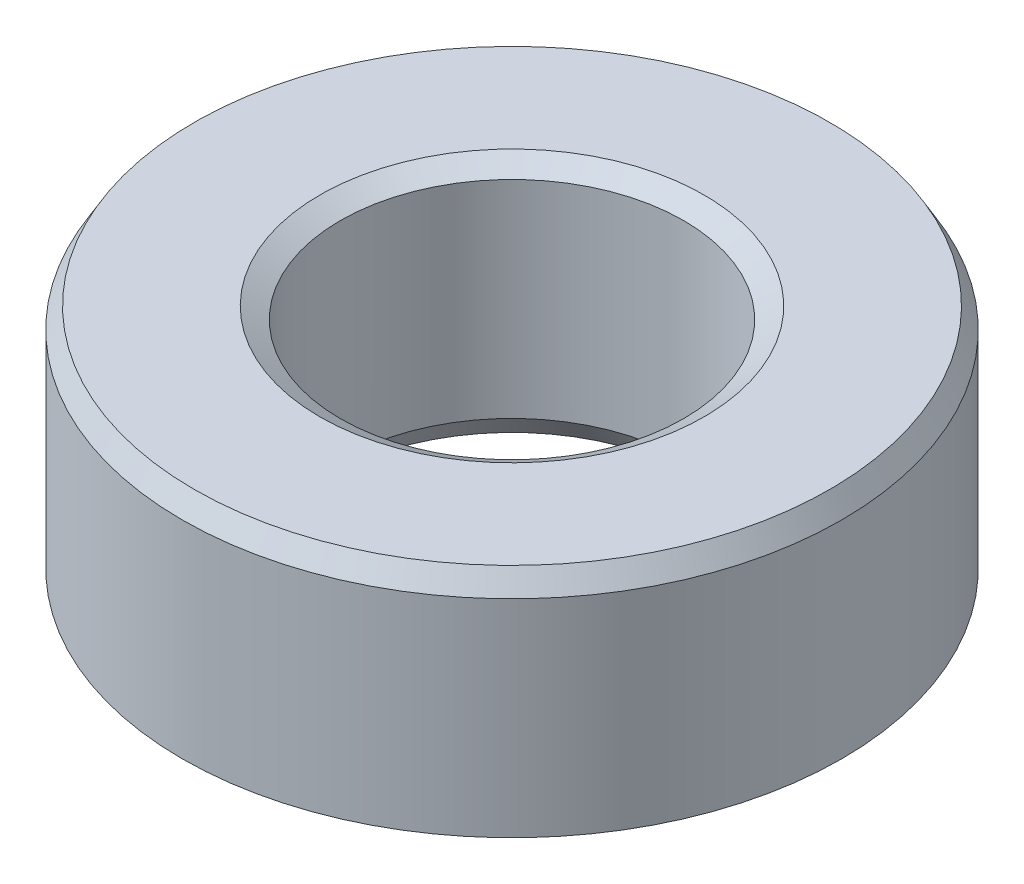
ISO-10303-21;
HEADER;
FILE_DESCRIPTION(('STEP AP214'),'2;1');
FILE_NAME('part.step','',(''),(''),'','','');
FILE_SCHEMA(('AUTOMOTIVE_DESIGN { 1 0 10303 214 1 1 1 1 }'));
ENDSEC;
DATA;
#1=APPLICATION_CONTEXT('core data for automotive mechanical design processes');
#2=APPLICATION_PROTOCOL_DEFINITION('international standard','automotive_design',2000,#1);
#3=PRODUCT_CONTEXT('',#1,'mechanical');
#4=PRODUCT('Part','Part','',(#3));
#5=PRODUCT_RELATED_PRODUCT_CATEGORY('part','',(#4));
#6=PRODUCT_DEFINITION_FORMATION('','',#4);
#7=PRODUCT_DEFINITION_CONTEXT('part definition',#1,'design');
#8=PRODUCT_DEFINITION('design','',#6,#7);
#9=PRODUCT_DEFINITION_SHAPE('','',#8);
#10=(LENGTH_UNIT() NAMED_UNIT(*) SI_UNIT(.MILLI.,.METRE.));
#11=(NAMED_UNIT(*) PLANE_ANGLE_UNIT() SI_UNIT($,.RADIAN.));
#12=(NAMED_UNIT(*) SI_UNIT($,.STERADIAN.) SOLID_ANGLE_UNIT());
#13=UNCERTAINTY_MEASURE_WITH_UNIT(LENGTH_MEASURE(1.E-05),#10,'distance_accuracy_value','');
#14=(GEOMETRIC_REPRESENTATION_CONTEXT(3) GLOBAL_UNCERTAINTY_ASSIGNED_CONTEXT((#13)) GLOBAL_UNIT_ASSIGNED_CONTEXT((#10,
#11,#12)) REPRESENTATION_CONTEXT('',''));
#15=CARTESIAN_POINT('',(0.,0.,0.));
#16=DIRECTION('',(0.,0.,1.));
#17=DIRECTION('',(1.,0.,0.));
#18=AXIS2_PLACEMENT_3D('',#15,#16,#17);
#19=CARTESIAN_POINT('',(0.,10.8877438997709,0.));
#20=DIRECTION('',(0.,-1.,0.));
#21=DIRECTION('',(0.,0.,-1.));
#22=AXIS2_PLACEMENT_3D('',#19,#20,#21);
#23=CYLINDRICAL_SURFACE('',#22,15.);
#24=CARTESIAN_POINT('',(0.,0.539486771125386,0.));
#25=DIRECTION('',(0.,1.,0.));
#26=DIRECTION('',(0.,0.,1.));
#27=AXIS2_PLACEMENT_3D('',#24,#25,#26);
#28=CIRCLE('',#27,15.);
#29=CARTESIAN_POINT('',(0.,0.539486771125386,15.));
#30=VERTEX_POINT('',#29);
#31=EDGE_CURVE('E10',#30,#30,#28,.T.);
#32=ORIENTED_EDGE('',*,*,#31,.T.);
#33=EDGE_LOOP('',(#32));
#34=FACE_BOUND('',#33,.T.);
#35=CARTESIAN_POINT('',(0.,9.95332540217048,0.));
#36=DIRECTION('',(0.,1.,0.));
#37=DIRECTION('',(0.,0.,1.));
#38=AXIS2_PLACEMENT_3D('',#35,#36,#37);
#39=CIRCLE('',#38,15.);
#40=CARTESIAN_POINT('',(0.,9.95332540217048,15.));
#41=VERTEX_POINT('',#40);
#42=EDGE_CURVE('E50',#41,#41,#39,.F.);
#43=ORIENTED_EDGE('',*,*,#42,.T.);
#44=EDGE_LOOP('',(#43));
#45=FACE_BOUND('',#44,.T.);
#46=ADVANCED_FACE('F39',(#34,#45),#23,.T.);
#47=CARTESIAN_POINT('',(0.,10.8877438997709,0.));
#48=DIRECTION('',(0.,1.,0.));
#49=DIRECTION('',(0.,0.,1.));
#50=AXIS2_PLACEMENT_3D('',#47,#48,#49);
#51=PLANE('',#50);
#52=CARTESIAN_POINT('',(0.,10.8877438997709,0.));
#53=DIRECTION('',(0.,1.,0.));
#54=DIRECTION('',(0.,0.,1.));
#55=AXIS2_PLACEMENT_3D('',#52,#53,#54);
#56=CIRCLE('',#55,8.74299915370484);
#57=CARTESIAN_POINT('',(0.,10.8877438997709,8.74299915370484));
#58=VERTEX_POINT('',#57);
#59=EDGE_CURVE('E58',#58,#58,#56,.F.);
#60=ORIENTED_EDGE('',*,*,#59,.T.);
#61=EDGE_LOOP('',(#60));
#62=FACE_BOUND('',#61,.T.);
#63=CARTESIAN_POINT('',(0.,10.8877438997709,0.));
#64=DIRECTION('',(0.,1.,0.));
#65=DIRECTION('',(0.,0.,1.));
#66=AXIS2_PLACEMENT_3D('',#63,#64,#65);
#67=CIRCLE('',#66,14.4605132288746);
#68=CARTESIAN_POINT('',(0.,10.8877438997709,14.4605132288746));
#69=VERTEX_POINT('',#68);
#70=EDGE_CURVE('E61',#69,#69,#67,.T.);
#71=ORIENTED_EDGE('',*,*,#70,.T.);
#72=EDGE_LOOP('',(#71));
#73=FACE_BOUND('',#72,.T.);
#74=ADVANCED_FACE('F88',(#62,#73),#51,.T.);
#75=CARTESIAN_POINT('',(0.,0.,0.));
#76=DIRECTION('',(0.,1.,0.));
#77=DIRECTION('',(0.,0.,1.));
#78=AXIS2_PLACEMENT_3D('',#75,#76,#77);
#79=PLANE('',#78);
#80=CARTESIAN_POINT('',(0.,0.,0.));
#81=DIRECTION('',(0.,1.,0.));
#82=DIRECTION('',(0.,0.,1.));
#83=AXIS2_PLACEMENT_3D('',#80,#81,#82);
#84=CIRCLE('',#83,8.34806742722975);
#85=CARTESIAN_POINT('',(0.,0.,-8.34806742722975));
#86=VERTEX_POINT('',#85);
#87=EDGE_CURVE('E51',#86,#86,#84,.T.);
#88=ORIENTED_EDGE('',*,*,#87,.T.);
#89=EDGE_LOOP('',(#88));
#90=FACE_BOUND('',#89,.T.);
#91=CARTESIAN_POINT('',(0.,0.,0.));
#92=DIRECTION('',(0.,1.,0.));
#93=DIRECTION('',(0.,0.,1.));
#94=AXIS2_PLACEMENT_3D('',#91,#92,#93);
#95=CIRCLE('',#94,14.0655815023995);
#96=CARTESIAN_POINT('',(0.,0.,14.0655815023995));
#97=VERTEX_POINT('',#96);
#98=EDGE_CURVE('E54',#97,#97,#95,.F.);
#99=ORIENTED_EDGE('',*,*,#98,.T.);
#100=EDGE_LOOP('',(#99));
#101=FACE_BOUND('',#100,.T.);
#102=ADVANCED_FACE('F83',(#90,#101),#79,.F.);
#103=CARTESIAN_POINT('',(0.,10.8877438997709,0.));
#104=DIRECTION('',(0.,-1.,0.));
#105=DIRECTION('',(0.,0.,-1.));
#106=AXIS2_PLACEMENT_3D('',#103,#104,#105);
#107=CYLINDRICAL_SURFACE('',#106,7.80858065610437);
#108=CARTESIAN_POINT('',(0.,10.3482571286455,0.));
#109=DIRECTION('',(0.,1.,0.));
#110=DIRECTION('',(0.,0.,1.));
#111=AXIS2_PLACEMENT_3D('',#108,#109,#110);
#112=CIRCLE('',#111,7.80858065610437);
#113=CARTESIAN_POINT('',(0.,10.3482571286455,7.80858065610437));
#114=VERTEX_POINT('',#113);
#115=EDGE_CURVE('E67',#114,#114,#112,.T.);
#116=ORIENTED_EDGE('',*,*,#115,.T.);
#117=EDGE_LOOP('',(#116));
#118=FACE_BOUND('',#117,.T.);
#119=CARTESIAN_POINT('',(0.,0.93441849760045,0.));
#120=DIRECTION('',(0.,1.,0.));
#121=DIRECTION('',(0.,0.,1.));
#122=AXIS2_PLACEMENT_3D('',#119,#120,#121);
#123=CIRCLE('',#122,7.80858065610437);
#124=CARTESIAN_POINT('',(0.,0.93441849760045,-7.80858065610437));
#125=VERTEX_POINT('',#124);
#126=EDGE_CURVE('E69',#125,#125,#123,.F.);
#127=ORIENTED_EDGE('',*,*,#126,.T.);
#128=EDGE_LOOP('',(#127));
#129=FACE_BOUND('',#128,.T.);
#130=ADVANCED_FACE('F71',(#118,#129),#107,.F.);
#131=CARTESIAN_POINT('',(0.,10.3482571286455,0.));
#132=DIRECTION('',(0.,1.,0.));
#133=DIRECTION('',(0.,0.,1.));
#134=AXIS2_PLACEMENT_3D('',#131,#132,#133);
#135=CONICAL_SURFACE('',#134,7.80858065610437,1.0471975511966);
#136=ORIENTED_EDGE('',*,*,#59,.F.);
#137=EDGE_LOOP('',(#136));
#138=FACE_BOUND('',#137,.T.);
#139=ORIENTED_EDGE('',*,*,#115,.F.);
#140=EDGE_LOOP('',(#139));
#141=FACE_BOUND('',#140,.T.);
#142=ADVANCED_FACE('F77',(#138,#141),#135,.F.);
#143=CARTESIAN_POINT('',(0.,0.,0.));
#144=DIRECTION('',(0.,-1.,0.));
#145=DIRECTION('',(0.,0.,-1.));
#146=AXIS2_PLACEMENT_3D('',#143,#144,#145);
#147=CONICAL_SURFACE('',#146,8.34806742722975,0.523598775598293);
#148=CARTESIAN_POINT('',(0.,0.93441849760045,-7.80858065610437));
#149=CARTESIAN_POINT('',(0.,0.924684971583778,-7.81420030997026));
#150=CARTESIAN_POINT('',(0.,0.914951445567107,-7.81981996383615));
#151=CARTESIAN_POINT('',(0.,0.895484393533764,-7.83105927156793));
#152=CARTESIAN_POINT('',(0.,0.885750867517093,-7.83667892543382));
#153=CARTESIAN_POINT('',(0.,0.86628381548375,-7.84791823316559));
#154=CARTESIAN_POINT('',(0.,0.856550289467079,-7.85353788703148));
#155=CARTESIAN_POINT('',(0.,0.837083237433736,-7.86477719476326));
#156=CARTESIAN_POINT('',(0.,0.827349711417065,-7.87039684862915));
#157=CARTESIAN_POINT('',(0.,0.807882659383722,-7.88163615636093));
#158=CARTESIAN_POINT('',(0.,0.798149133367051,-7.88725581022682));
#159=CARTESIAN_POINT('',(0.,0.778682081333708,-7.8984951179586));
#160=CARTESIAN_POINT('',(0.,0.768948555317037,-7.90411477182449));
#161=CARTESIAN_POINT('',(0.,0.749481503283694,-7.91535407955627));
#162=CARTESIAN_POINT('',(0.,0.739747977267023,-7.92097373342216));
#163=CARTESIAN_POINT('',(0.,0.72028092523368,-7.93221304115393));
#164=CARTESIAN_POINT('',(0.,0.710547399217009,-7.93783269501982));
#165=CARTESIAN_POINT('',(0.,0.691080347183666,-7.9490720027516));
#166=CARTESIAN_POINT('',(0.,0.681346821166995,-7.95469165661749));
#167=CARTESIAN_POINT('',(0.,0.661879769133652,-7.96593096434927));
#168=CARTESIAN_POINT('',(0.,0.65214624311698,-7.97155061821516));
#169=CARTESIAN_POINT('',(0.,0.632679191083638,-7.98278992594694));
#170=CARTESIAN_POINT('',(0.,0.622945665066966,-7.98840957981283));
#171=CARTESIAN_POINT('',(0.,0.603478613033624,-7.99964888754461));
#172=CARTESIAN_POINT('',(0.,0.593745087016952,-8.0052685414105));
#173=CARTESIAN_POINT('',(0.,0.57427803498361,-8.01650784914228));
#174=CARTESIAN_POINT('',(0.,0.564544508966938,-8.02212750300816));
#175=CARTESIAN_POINT('',(0.,0.545077456933596,-8.03336681073994));
#176=CARTESIAN_POINT('',(0.,0.535343930916924,-8.03898646460583));
#177=CARTESIAN_POINT('',(0.,0.515876878883582,-8.05022577233761));
#178=CARTESIAN_POINT('',(0.,0.50614335286691,-8.0558454262035));
#179=CARTESIAN_POINT('',(0.,0.486676300833567,-8.06708473393528));
#180=CARTESIAN_POINT('',(0.,0.476942774816896,-8.07270438780117));
#181=CARTESIAN_POINT('',(0.,0.457475722783554,-8.08394369553295));
#182=CARTESIAN_POINT('',(0.,0.447742196766882,-8.08956334939884));
#183=CARTESIAN_POINT('',(0.,0.428275144733539,-8.10080265713061));
#184=CARTESIAN_POINT('',(0.,0.418541618716868,-8.1064223109965));
#185=CARTESIAN_POINT('',(0.,0.399074566683525,-8.11766161872828));
#186=CARTESIAN_POINT('',(0.,0.389341040666854,-8.12328127259417));
#187=CARTESIAN_POINT('',(0.,0.369873988633512,-8.13452058032595));
#188=CARTESIAN_POINT('',(0.,0.36014046261684,-8.14014023419184));
#189=CARTESIAN_POINT('',(0.,0.340673410583497,-8.15137954192362));
#190=CARTESIAN_POINT('',(0.,0.330939884566826,-8.15699919578951));
#191=CARTESIAN_POINT('',(0.,0.311472832533483,-8.16823850352129));
#192=CARTESIAN_POINT('',(0.,0.301739306516812,-8.17385815738718));
#193=CARTESIAN_POINT('',(0.,0.282272254483469,-8.18509746511896));
#194=CARTESIAN_POINT('',(0.,0.272538728466798,-8.19071711898484));
#195=CARTESIAN_POINT('',(0.,0.253071676433455,-8.20195642671662));
#196=CARTESIAN_POINT('',(0.,0.243338150416784,-8.20757608058251));
#197=CARTESIAN_POINT('',(0.,0.223871098383441,-8.21881538831429));
#198=CARTESIAN_POINT('',(0.,0.21413757236677,-8.22443504218018));
#199=CARTESIAN_POINT('',(0.,0.194670520333427,-8.23567434991196));
#200=CARTESIAN_POINT('',(0.,0.184936994316756,-8.24129400377785));
#201=CARTESIAN_POINT('',(0.,0.165469942283413,-8.25253331150963));
#202=CARTESIAN_POINT('',(0.,0.155736416266742,-8.25815296537552));
#203=CARTESIAN_POINT('',(0.,0.136269364233399,-8.2693922731073));
#204=CARTESIAN_POINT('',(0.,0.126535838216728,-8.27501192697319));
#205=CARTESIAN_POINT('',(0.,0.107068786183385,-8.28625123470496));
#206=CARTESIAN_POINT('',(0.,0.0973352601667135,-8.29187088857085));
#207=CARTESIAN_POINT('',(0.,0.0778682081333708,-8.30311019630263));
#208=CARTESIAN_POINT('',(0.,0.0681346821166993,-8.30872985016852));
#209=CARTESIAN_POINT('',(0.,0.0486676300833566,-8.3199691579003));
#210=CARTESIAN_POINT('',(0.,0.0389341040666854,-8.32558881176619));
#211=CARTESIAN_POINT('',(0.,0.019467052033343,-8.33682811949797));
#212=CARTESIAN_POINT('',(0.,0.00973352601667173,-8.34244777336386));
#213=CARTESIAN_POINT('',(0.,0.,-8.34806742722975));
#214=B_SPLINE_CURVE_WITH_KNOTS('',3,(#148,#149,#150,#151,#152,#153,#154,#155,#156,#157,#158,
#159,#160,#161,#162,#163,#164,#165,#166,#167,#168,#169,#170,#171,#172,#173,#174,#175,#176,#177,
#178,#179,#180,#181,#182,#183,#184,#185,#186,#187,#188,#189,#190,#191,#192,#193,#194,#195,#196,
#197,#198,#199,#200,#201,#202,#203,#204,#205,#206,#207,#208,#209,#210,#211,#212,#213),
.UNSPECIFIED.,.F.,.F.,(4,2,2,2,2,2,2,2,2,2,2,2,2,2,2,2,2,2,2,2,2,2,2,2,2,2,2,2,2,2,2,2,4),(0.,
0.0337179231953367,0.0674358463906729,0.101153769586009,0.134871692781346,0.168589615976683,
0.202307539172019,0.236025462367355,0.269743385562692,0.303461308758028,0.337179231953365,
0.370897155148701,0.404615078344038,0.438333001539374,0.472050924734711,0.505768847930047,
0.539486771125384,0.57320469432072,0.606922617516056,0.640640540711393,0.67435846390673,
0.708076387102066,0.741794310297402,0.775512233492739,0.809230156688075,0.842948079883412,
0.876666003078748,0.910383926274085,0.944101849469421,0.977819772664757,1.01153769586009,
1.04525561905543,1.07897354225077),.UNSPECIFIED.);
#215=EDGE_CURVE('BSEAM73',#125,#86,#214,.T.);
#216=ORIENTED_EDGE('',*,*,#126,.F.);
#217=ORIENTED_EDGE('',*,*,#87,.F.);
#218=ORIENTED_EDGE('',*,*,#215,.T.);
#219=ORIENTED_EDGE('',*,*,#215,.F.);
#220=EDGE_LOOP('',(#216,#218,#217,#219));
#221=FACE_BOUND('',#220,.T.);
#222=ADVANCED_FACE('F73',(#221),#147,.F.);
#223=CARTESIAN_POINT('',(0.,0.539486771125386,0.));
#224=DIRECTION('',(0.,1.,0.));
#225=DIRECTION('',(0.,0.,1.));
#226=AXIS2_PLACEMENT_3D('',#223,#224,#225);
#227=CONICAL_SURFACE('',#226,15.,1.0471975511966);
#228=ORIENTED_EDGE('',*,*,#98,.F.);
#229=EDGE_LOOP('',(#228));
#230=FACE_BOUND('',#229,.T.);
#231=ORIENTED_EDGE('',*,*,#31,.F.);
#232=EDGE_LOOP('',(#231));
#233=FACE_BOUND('',#232,.T.);
#234=ADVANCED_FACE('F76',(#230,#233),#227,.T.);
#235=CARTESIAN_POINT('',(0.,10.8877438997709,0.));
#236=DIRECTION('',(0.,-1.,0.));
#237=DIRECTION('',(0.,0.,-1.));
#238=AXIS2_PLACEMENT_3D('',#235,#236,#237);
#239=CONICAL_SURFACE('',#238,14.4605132288746,0.5235987755983);
#240=ORIENTED_EDGE('',*,*,#42,.F.);
#241=EDGE_LOOP('',(#240));
#242=FACE_BOUND('',#241,.T.);
#243=ORIENTED_EDGE('',*,*,#70,.F.);
#244=EDGE_LOOP('',(#243));
#245=FACE_BOUND('',#244,.T.);
#246=ADVANCED_FACE('F45',(#242,#245),#239,.T.);
#247=CLOSED_SHELL('',(#46,#74,#102,#130,#142,#222,#234,#246));
#248=MANIFOLD_SOLID_BREP('B2',#247);
#249=ADVANCED_BREP_SHAPE_REPRESENTATION('',(#18,#248),#14);
#250=SHAPE_DEFINITION_REPRESENTATION(#9,#249);
ENDSEC;
END-ISO-10303-21;
